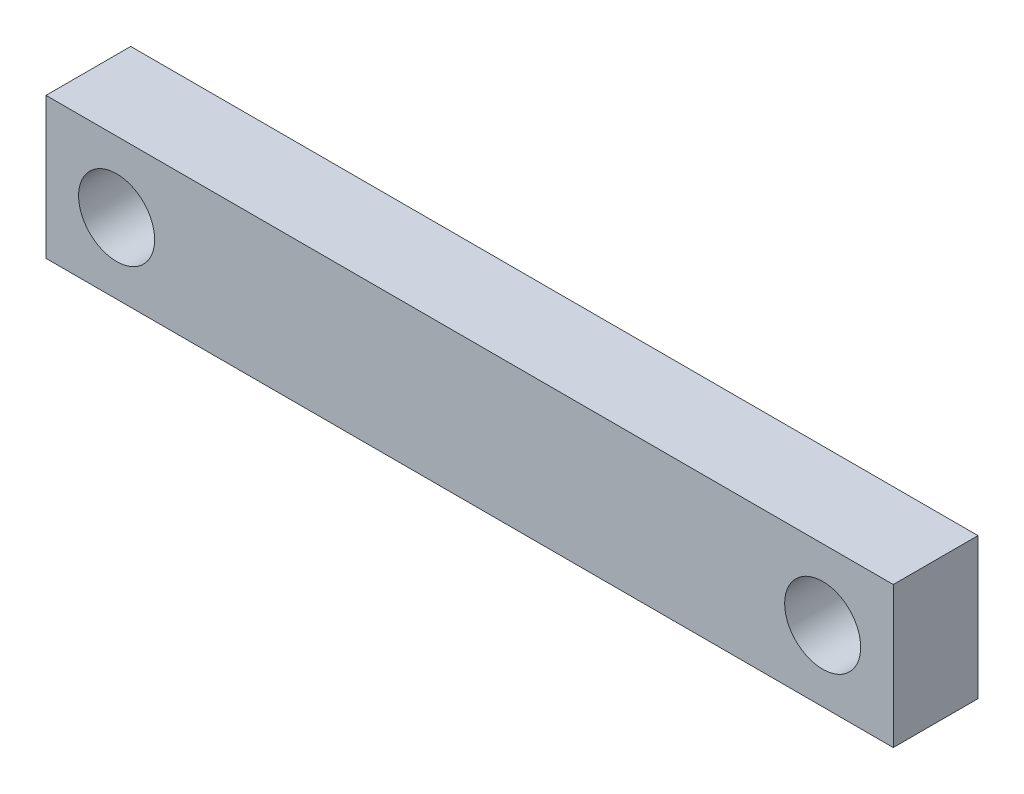
ISO-10303-21;
HEADER;
FILE_DESCRIPTION(('STEP AP214'),'2;1');
FILE_NAME('part.step','',(''),(''),'','','');
FILE_SCHEMA(('AUTOMOTIVE_DESIGN { 1 0 10303 214 1 1 1 1 }'));
ENDSEC;
DATA;
#1=APPLICATION_CONTEXT('core data for automotive mechanical design processes');
#2=APPLICATION_PROTOCOL_DEFINITION('international standard','automotive_design',2000,#1);
#3=PRODUCT_CONTEXT('',#1,'mechanical');
#4=PRODUCT('Part','Part','',(#3));
#5=PRODUCT_RELATED_PRODUCT_CATEGORY('part','',(#4));
#6=PRODUCT_DEFINITION_FORMATION('','',#4);
#7=PRODUCT_DEFINITION_CONTEXT('part definition',#1,'design');
#8=PRODUCT_DEFINITION('design','',#6,#7);
#9=PRODUCT_DEFINITION_SHAPE('','',#8);
#10=(LENGTH_UNIT() NAMED_UNIT(*) SI_UNIT(.MILLI.,.METRE.));
#11=(NAMED_UNIT(*) PLANE_ANGLE_UNIT() SI_UNIT($,.RADIAN.));
#12=(NAMED_UNIT(*) SI_UNIT($,.STERADIAN.) SOLID_ANGLE_UNIT());
#13=UNCERTAINTY_MEASURE_WITH_UNIT(LENGTH_MEASURE(1.E-05),#10,'distance_accuracy_value','');
#14=(GEOMETRIC_REPRESENTATION_CONTEXT(3) GLOBAL_UNCERTAINTY_ASSIGNED_CONTEXT((#13)) GLOBAL_UNIT_ASSIGNED_CONTEXT((#10,
#11,#12)) REPRESENTATION_CONTEXT('',''));
#15=CARTESIAN_POINT('',(0.,0.,0.));
#16=DIRECTION('',(0.,0.,1.));
#17=DIRECTION('',(1.,0.,0.));
#18=AXIS2_PLACEMENT_3D('',#15,#16,#17);
#19=CARTESIAN_POINT('',(0.,0.,3.));
#20=DIRECTION('',(0.,0.,-1.));
#21=DIRECTION('',(-1.,0.,0.));
#22=AXIS2_PLACEMENT_3D('',#19,#20,#21);
#23=PLANE('',#22);
#24=CARTESIAN_POINT('',(2.49999999999999,2.5,3.));
#25=DIRECTION('',(0.,0.,1.));
#26=DIRECTION('',(1.,0.,0.));
#27=AXIS2_PLACEMENT_3D('',#24,#25,#26);
#28=CIRCLE('',#27,1.34615010406005);
#29=CARTESIAN_POINT('',(3.84615010406004,2.5,3.));
#30=VERTEX_POINT('',#29);
#31=EDGE_CURVE('E100',#30,#30,#28,.T.);
#32=ORIENTED_EDGE('',*,*,#31,.F.);
#33=EDGE_LOOP('',(#32));
#34=FACE_BOUND('',#33,.T.);
#35=DIRECTION('',(0.,-1.,0.));
#36=VECTOR('',#35,1.);
#37=CARTESIAN_POINT('',(0.,0.,3.));
#38=LINE('',#37,#36);
#39=CARTESIAN_POINT('',(0.,5.,3.));
#40=VERTEX_POINT('',#39);
#41=CARTESIAN_POINT('',(0.,0.,3.));
#42=VERTEX_POINT('',#41);
#43=EDGE_CURVE('E85',#40,#42,#38,.T.);
#44=ORIENTED_EDGE('',*,*,#43,.T.);
#45=DIRECTION('',(1.,0.,0.));
#46=VECTOR('',#45,1.);
#47=CARTESIAN_POINT('',(0.,0.,3.));
#48=LINE('',#47,#46);
#49=CARTESIAN_POINT('',(30.,0.,3.));
#50=VERTEX_POINT('',#49);
#51=EDGE_CURVE('E80',#42,#50,#48,.T.);
#52=ORIENTED_EDGE('',*,*,#51,.T.);
#53=DIRECTION('',(0.,1.,0.));
#54=VECTOR('',#53,1.);
#55=CARTESIAN_POINT('',(30.,0.,3.));
#56=LINE('',#55,#54);
#57=CARTESIAN_POINT('',(30.,5.,3.));
#58=VERTEX_POINT('',#57);
#59=EDGE_CURVE('E83',#50,#58,#56,.T.);
#60=ORIENTED_EDGE('',*,*,#59,.T.);
#61=DIRECTION('',(-1.,0.,0.));
#62=VECTOR('',#61,1.);
#63=CARTESIAN_POINT('',(0.,5.,3.));
#64=LINE('',#63,#62);
#65=EDGE_CURVE('E50',#58,#40,#64,.T.);
#66=ORIENTED_EDGE('',*,*,#65,.T.);
#67=EDGE_LOOP('',(#44,#52,#60,#66));
#68=FACE_BOUND('',#67,.T.);
#69=CARTESIAN_POINT('',(27.5,2.5,3.));
#70=DIRECTION('',(0.,0.,1.));
#71=DIRECTION('',(-1.,0.,0.));
#72=AXIS2_PLACEMENT_3D('',#69,#70,#71);
#73=CIRCLE('',#72,1.34615010406005);
#74=CARTESIAN_POINT('',(26.1538498959399,2.5,3.));
#75=VERTEX_POINT('',#74);
#76=EDGE_CURVE('E115',#75,#75,#73,.T.);
#77=ORIENTED_EDGE('',*,*,#76,.F.);
#78=EDGE_LOOP('',(#77));
#79=FACE_BOUND('',#78,.T.);
#80=ADVANCED_FACE('F33',(#34,#68,#79),#23,.F.);
#81=CARTESIAN_POINT('',(0.,0.,0.));
#82=DIRECTION('',(0.,0.,-1.));
#83=DIRECTION('',(-1.,0.,0.));
#84=AXIS2_PLACEMENT_3D('',#81,#82,#83);
#85=PLANE('',#84);
#86=CARTESIAN_POINT('',(2.49999999999999,2.5,0.));
#87=DIRECTION('',(0.,0.,1.));
#88=DIRECTION('',(1.,0.,0.));
#89=AXIS2_PLACEMENT_3D('',#86,#87,#88);
#90=CIRCLE('',#89,1.34615010406005);
#91=CARTESIAN_POINT('',(3.84615010406004,2.5,0.));
#92=VERTEX_POINT('',#91);
#93=EDGE_CURVE('E112',#92,#92,#90,.T.);
#94=ORIENTED_EDGE('',*,*,#93,.T.);
#95=EDGE_LOOP('',(#94));
#96=FACE_BOUND('',#95,.T.);
#97=DIRECTION('',(0.,-1.,0.));
#98=VECTOR('',#97,1.);
#99=CARTESIAN_POINT('',(0.,0.,0.));
#100=LINE('',#99,#98);
#101=CARTESIAN_POINT('',(0.,5.,0.));
#102=VERTEX_POINT('',#101);
#103=CARTESIAN_POINT('',(0.,0.,0.));
#104=VERTEX_POINT('',#103);
#105=EDGE_CURVE('E97',#102,#104,#100,.T.);
#106=ORIENTED_EDGE('',*,*,#105,.F.);
#107=DIRECTION('',(-1.,0.,0.));
#108=VECTOR('',#107,1.);
#109=CARTESIAN_POINT('',(0.,5.,0.));
#110=LINE('',#109,#108);
#111=CARTESIAN_POINT('',(30.,5.,0.));
#112=VERTEX_POINT('',#111);
#113=EDGE_CURVE('E73',#112,#102,#110,.T.);
#114=ORIENTED_EDGE('',*,*,#113,.F.);
#115=DIRECTION('',(0.,1.,0.));
#116=VECTOR('',#115,1.);
#117=CARTESIAN_POINT('',(30.,0.,0.));
#118=LINE('',#117,#116);
#119=CARTESIAN_POINT('',(30.,0.,0.));
#120=VERTEX_POINT('',#119);
#121=EDGE_CURVE('E67',#120,#112,#118,.T.);
#122=ORIENTED_EDGE('',*,*,#121,.F.);
#123=DIRECTION('',(1.,0.,0.));
#124=VECTOR('',#123,1.);
#125=CARTESIAN_POINT('',(0.,0.,0.));
#126=LINE('',#125,#124);
#127=EDGE_CURVE('E89',#104,#120,#126,.T.);
#128=ORIENTED_EDGE('',*,*,#127,.F.);
#129=EDGE_LOOP('',(#106,#114,#122,#128));
#130=FACE_BOUND('',#129,.T.);
#131=CARTESIAN_POINT('',(27.5,2.5,0.));
#132=DIRECTION('',(0.,0.,1.));
#133=DIRECTION('',(-1.,0.,0.));
#134=AXIS2_PLACEMENT_3D('',#131,#132,#133);
#135=CIRCLE('',#134,1.34615010406005);
#136=CARTESIAN_POINT('',(26.1538498959399,2.5,0.));
#137=VERTEX_POINT('',#136);
#138=EDGE_CURVE('E118',#137,#137,#135,.T.);
#139=ORIENTED_EDGE('',*,*,#138,.T.);
#140=EDGE_LOOP('',(#139));
#141=FACE_BOUND('',#140,.T.);
#142=ADVANCED_FACE('F108',(#96,#130,#141),#85,.T.);
#143=CARTESIAN_POINT('',(0.,0.,3.));
#144=DIRECTION('',(1.,0.,0.));
#145=DIRECTION('',(0.,0.,-1.));
#146=AXIS2_PLACEMENT_3D('',#143,#144,#145);
#147=PLANE('',#146);
#148=ORIENTED_EDGE('',*,*,#105,.T.);
#149=DIRECTION('',(0.,0.,-1.));
#150=VECTOR('',#149,1.);
#151=CARTESIAN_POINT('',(0.,0.,3.));
#152=LINE('',#151,#150);
#153=EDGE_CURVE('E11',#42,#104,#152,.T.);
#154=ORIENTED_EDGE('',*,*,#153,.F.);
#155=ORIENTED_EDGE('',*,*,#43,.F.);
#156=DIRECTION('',(0.,0.,-1.));
#157=VECTOR('',#156,1.);
#158=CARTESIAN_POINT('',(0.,5.,3.));
#159=LINE('',#158,#157);
#160=EDGE_CURVE('E93',#40,#102,#159,.T.);
#161=ORIENTED_EDGE('',*,*,#160,.T.);
#162=EDGE_LOOP('',(#148,#154,#155,#161));
#163=FACE_BOUND('',#162,.T.);
#164=ADVANCED_FACE('F35',(#163),#147,.F.);
#165=CARTESIAN_POINT('',(0.,0.,3.));
#166=DIRECTION('',(0.,1.,0.));
#167=DIRECTION('',(0.,0.,1.));
#168=AXIS2_PLACEMENT_3D('',#165,#166,#167);
#169=PLANE('',#168);
#170=ORIENTED_EDGE('',*,*,#127,.T.);
#171=DIRECTION('',(0.,0.,-1.));
#172=VECTOR('',#171,1.);
#173=CARTESIAN_POINT('',(30.,0.,3.));
#174=LINE('',#173,#172);
#175=EDGE_CURVE('E42',#50,#120,#174,.T.);
#176=ORIENTED_EDGE('',*,*,#175,.F.);
#177=ORIENTED_EDGE('',*,*,#51,.F.);
#178=ORIENTED_EDGE('',*,*,#153,.T.);
#179=EDGE_LOOP('',(#170,#176,#177,#178));
#180=FACE_BOUND('',#179,.T.);
#181=ADVANCED_FACE('F88',(#180),#169,.F.);
#182=CARTESIAN_POINT('',(30.,0.,3.));
#183=DIRECTION('',(-1.,0.,0.));
#184=DIRECTION('',(0.,0.,1.));
#185=AXIS2_PLACEMENT_3D('',#182,#183,#184);
#186=PLANE('',#185);
#187=ORIENTED_EDGE('',*,*,#121,.T.);
#188=DIRECTION('',(0.,0.,-1.));
#189=VECTOR('',#188,1.);
#190=CARTESIAN_POINT('',(30.,5.,3.));
#191=LINE('',#190,#189);
#192=EDGE_CURVE('E90',#58,#112,#191,.T.);
#193=ORIENTED_EDGE('',*,*,#192,.F.);
#194=ORIENTED_EDGE('',*,*,#59,.F.);
#195=ORIENTED_EDGE('',*,*,#175,.T.);
#196=EDGE_LOOP('',(#187,#193,#194,#195));
#197=FACE_BOUND('',#196,.T.);
#198=ADVANCED_FACE('F91',(#197),#186,.F.);
#199=CARTESIAN_POINT('',(0.,5.,3.));
#200=DIRECTION('',(0.,-1.,0.));
#201=DIRECTION('',(0.,0.,-1.));
#202=AXIS2_PLACEMENT_3D('',#199,#200,#201);
#203=PLANE('',#202);
#204=ORIENTED_EDGE('',*,*,#113,.T.);
#205=ORIENTED_EDGE('',*,*,#160,.F.);
#206=ORIENTED_EDGE('',*,*,#65,.F.);
#207=ORIENTED_EDGE('',*,*,#192,.T.);
#208=EDGE_LOOP('',(#204,#205,#206,#207));
#209=FACE_BOUND('',#208,.T.);
#210=ADVANCED_FACE('F105',(#209),#203,.F.);
#211=CARTESIAN_POINT('',(2.49999999999999,2.5,3.));
#212=DIRECTION('',(0.,0.,-1.));
#213=DIRECTION('',(-1.,0.,0.));
#214=AXIS2_PLACEMENT_3D('',#211,#212,#213);
#215=CYLINDRICAL_SURFACE('',#214,1.34615010406005);
#216=ORIENTED_EDGE('',*,*,#31,.T.);
#217=EDGE_LOOP('',(#216));
#218=FACE_BOUND('',#217,.T.);
#219=ORIENTED_EDGE('',*,*,#93,.F.);
#220=EDGE_LOOP('',(#219));
#221=FACE_BOUND('',#220,.T.);
#222=ADVANCED_FACE('F136',(#218,#221),#215,.F.);
#223=CARTESIAN_POINT('',(27.5,2.5,3.));
#224=DIRECTION('',(0.,0.,-1.));
#225=DIRECTION('',(-1.,0.,0.));
#226=AXIS2_PLACEMENT_3D('',#223,#224,#225);
#227=CYLINDRICAL_SURFACE('',#226,1.34615010406005);
#228=ORIENTED_EDGE('',*,*,#76,.T.);
#229=EDGE_LOOP('',(#228));
#230=FACE_BOUND('',#229,.T.);
#231=ORIENTED_EDGE('',*,*,#138,.F.);
#232=EDGE_LOOP('',(#231));
#233=FACE_BOUND('',#232,.T.);
#234=ADVANCED_FACE('F124',(#230,#233),#227,.F.);
#235=CLOSED_SHELL('',(#80,#142,#164,#181,#198,#210,#222,#234));
#236=MANIFOLD_SOLID_BREP('B2',#235);
#237=ADVANCED_BREP_SHAPE_REPRESENTATION('',(#18,#236),#14);
#238=SHAPE_DEFINITION_REPRESENTATION(#9,#237);
ENDSEC;
END-ISO-10303-21;
